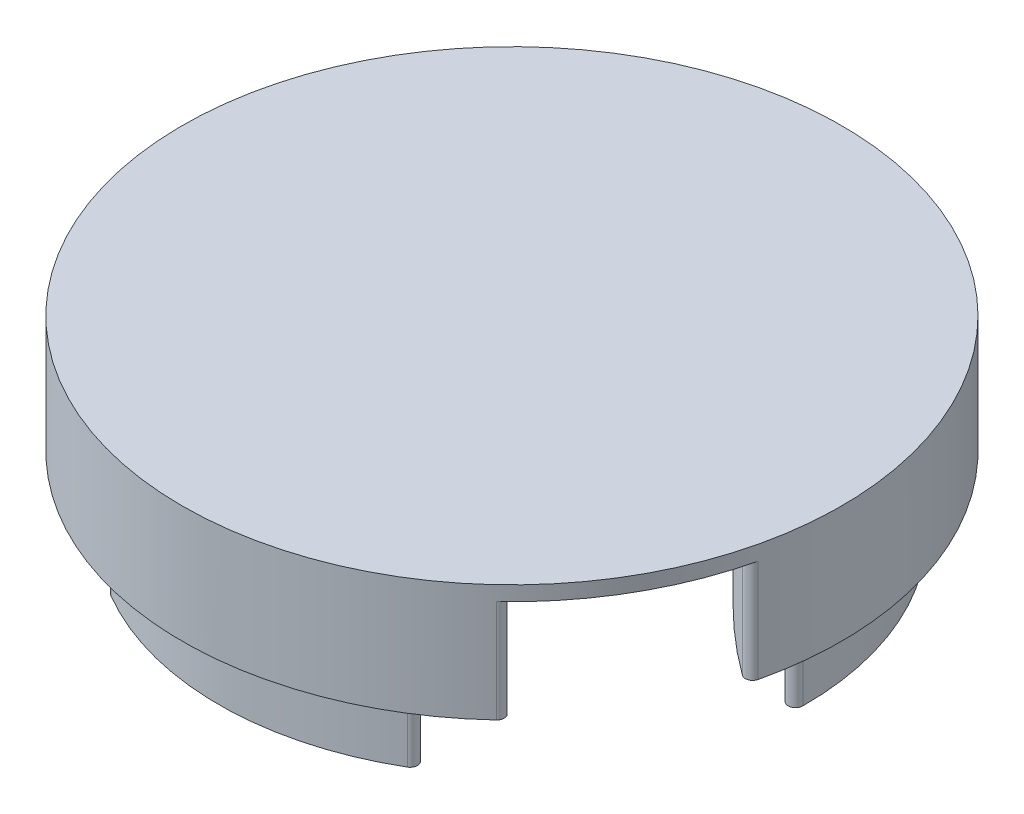
ISO-10303-21;
HEADER;
FILE_DESCRIPTION(('STEP AP214'),'2;1');
FILE_NAME('part.step','',(''),(''),'','','');
FILE_SCHEMA(('AUTOMOTIVE_DESIGN { 1 0 10303 214 1 1 1 1 }'));
ENDSEC;
DATA;
#1=APPLICATION_CONTEXT('core data for automotive mechanical design processes');
#2=APPLICATION_PROTOCOL_DEFINITION('international standard','automotive_design',2000,#1);
#3=PRODUCT_CONTEXT('',#1,'mechanical');
#4=PRODUCT('Part','Part','',(#3));
#5=PRODUCT_RELATED_PRODUCT_CATEGORY('part','',(#4));
#6=PRODUCT_DEFINITION_FORMATION('','',#4);
#7=PRODUCT_DEFINITION_CONTEXT('part definition',#1,'design');
#8=PRODUCT_DEFINITION('design','',#6,#7);
#9=PRODUCT_DEFINITION_SHAPE('','',#8);
#10=(LENGTH_UNIT() NAMED_UNIT(*) SI_UNIT(.MILLI.,.METRE.));
#11=(NAMED_UNIT(*) PLANE_ANGLE_UNIT() SI_UNIT($,.RADIAN.));
#12=(NAMED_UNIT(*) SI_UNIT($,.STERADIAN.) SOLID_ANGLE_UNIT());
#13=UNCERTAINTY_MEASURE_WITH_UNIT(LENGTH_MEASURE(1.E-05),#10,'distance_accuracy_value','');
#14=(GEOMETRIC_REPRESENTATION_CONTEXT(3) GLOBAL_UNCERTAINTY_ASSIGNED_CONTEXT((#13)) GLOBAL_UNIT_ASSIGNED_CONTEXT((#10,
#11,#12)) REPRESENTATION_CONTEXT('',''));
#15=CARTESIAN_POINT('',(0.,0.,0.));
#16=DIRECTION('',(0.,0.,1.));
#17=DIRECTION('',(1.,0.,0.));
#18=AXIS2_PLACEMENT_3D('',#15,#16,#17);
#19=CARTESIAN_POINT('',(0.,0.,0.));
#20=DIRECTION('',(0.,1.,0.));
#21=DIRECTION('',(0.,0.,1.));
#22=AXIS2_PLACEMENT_3D('',#19,#20,#21);
#23=PLANE('',#22);
#24=CARTESIAN_POINT('',(0.,0.,0.));
#25=DIRECTION('',(0.,-1.,0.));
#26=DIRECTION('',(0.866025403784443,0.,0.499999999999992));
#27=AXIS2_PLACEMENT_3D('',#24,#25,#26);
#28=CIRCLE('',#27,40.);
#29=CARTESIAN_POINT('',(-39.9989783773547,0.,0.285882437224215));
#30=VERTEX_POINT('',#29);
#31=CARTESIAN_POINT('',(-19.7519077355458,0.,-34.7830726188255));
#32=VERTEX_POINT('',#31);
#33=EDGE_CURVE('E392',#30,#32,#28,.T.);
#34=ORIENTED_EDGE('',*,*,#33,.F.);
#35=CARTESIAN_POINT('',(-38.9990039179208,0.,0.27873537629361));
#36=DIRECTION('',(0.,1.,0.));
#37=DIRECTION('',(0.,0.,1.));
#38=AXIS2_PLACEMENT_3D('',#35,#36,#37);
#39=CIRCLE('',#38,1.);
#40=CARTESIAN_POINT('',(-38.3114796497831,0.,1.0048967775824));
#41=VERTEX_POINT('',#40);
#42=EDGE_CURVE('E304',#30,#41,#39,.T.);
#43=ORIENTED_EDGE('',*,*,#42,.T.);
#44=CARTESIAN_POINT('',(-86.6025403784442,0.,-49.9999999999995));
#45=DIRECTION('',(0.,-1.,0.));
#46=DIRECTION('',(0.866025403784443,0.,0.499999999999992));
#47=AXIS2_PLACEMENT_3D('',#44,#45,#46);
#48=CIRCLE('',#47,70.2390635016656);
#49=CARTESIAN_POINT('',(-18.2854736873245,0.,-33.6811630220737));
#50=VERTEX_POINT('',#49);
#51=EDGE_CURVE('E394',#50,#41,#48,.T.);
#52=ORIENTED_EDGE('',*,*,#51,.F.);
#53=CARTESIAN_POINT('',(-19.2581100421572,0.,-33.9134958033548));
#54=DIRECTION('',(0.,1.,0.));
#55=DIRECTION('',(0.,0.,1.));
#56=AXIS2_PLACEMENT_3D('',#53,#54,#55);
#57=CIRCLE('',#56,1.);
#58=EDGE_CURVE('E306',#50,#32,#57,.T.);
#59=ORIENTED_EDGE('',*,*,#58,.T.);
#60=EDGE_LOOP('',(#34,#43,#52,#59));
#61=FACE_BOUND('',#60,.T.);
#62=CARTESIAN_POINT('',(0.,0.,0.));
#63=DIRECTION('',(0.,1.,0.));
#64=DIRECTION('',(0.,0.,1.));
#65=AXIS2_PLACEMENT_3D('',#62,#63,#64);
#66=CIRCLE('',#65,45.);
#67=CARTESIAN_POINT('',(-13.0753936075589,0.,-43.0584960490657));
#68=VERTEX_POINT('',#67);
#69=CARTESIAN_POINT('',(-43.8274482310223,0.,10.2056249959059));
#70=VERTEX_POINT('',#69);
#71=EDGE_CURVE('E254',#68,#70,#66,.T.);
#72=ORIENTED_EDGE('',*,*,#71,.F.);
#73=CARTESIAN_POINT('',(-12.7848293051687,0.,-42.1016405813087));
#74=DIRECTION('',(0.,1.,0.));
#75=DIRECTION('',(0.,0.,1.));
#76=AXIS2_PLACEMENT_3D('',#73,#74,#75);
#77=CIRCLE('',#76,1.);
#78=CARTESIAN_POINT('',(-11.790504921327,0.,-41.9952496996604));
#79=VERTEX_POINT('',#78);
#80=EDGE_CURVE('E53',#68,#79,#77,.F.);
#81=ORIENTED_EDGE('',*,*,#80,.T.);
#82=CARTESIAN_POINT('',(-86.6025403784437,0.,-50.0000000000003));
#83=DIRECTION('',(0.,1.,0.));
#84=DIRECTION('',(0.,0.,1.));
#85=AXIS2_PLACEMENT_3D('',#82,#83,#84);
#86=CIRCLE('',#85,75.2390635016656);
#87=CARTESIAN_POINT('',(-42.2642055388403,0.,10.7867480645152));
#88=VERTEX_POINT('',#87);
#89=EDGE_CURVE('E251',#88,#79,#86,.T.);
#90=ORIENTED_EDGE('',*,*,#89,.F.);
#91=CARTESIAN_POINT('',(-42.8535049369996,0.,9.97883332933023));
#92=DIRECTION('',(0.,1.,0.));
#93=DIRECTION('',(0.,0.,1.));
#94=AXIS2_PLACEMENT_3D('',#91,#92,#93);
#95=CIRCLE('',#94,1.);
#96=EDGE_CURVE('E61',#88,#70,#95,.F.);
#97=ORIENTED_EDGE('',*,*,#96,.T.);
#98=EDGE_LOOP('',(#72,#81,#90,#97));
#99=FACE_BOUND('',#98,.T.);
#100=ADVANCED_FACE('F38',(#61,#99),#23,.F.);
#101=CARTESIAN_POINT('',(0.,0.,0.));
#102=DIRECTION('',(0.,-1.,0.));
#103=DIRECTION('',(-0.866025403784436,0.,0.500000000000004));
#104=AXIS2_PLACEMENT_3D('',#101,#102,#103);
#105=CIRCLE('',#104,40.);
#106=CARTESIAN_POINT('',(19.7519077355456,0.,-34.7830726188256));
#107=VERTEX_POINT('',#106);
#108=CARTESIAN_POINT('',(39.9989783773547,0.,0.285882437223873));
#109=VERTEX_POINT('',#108);
#110=EDGE_CURVE('E408',#107,#109,#105,.T.);
#111=ORIENTED_EDGE('',*,*,#110,.F.);
#112=CARTESIAN_POINT('',(19.2581100421569,0.,-33.913495803355));
#113=DIRECTION('',(0.,1.,0.));
#114=DIRECTION('',(0.,0.,1.));
#115=AXIS2_PLACEMENT_3D('',#112,#113,#114);
#116=CIRCLE('',#115,1.);
#117=CARTESIAN_POINT('',(18.2854736873243,0.,-33.6811630220738));
#118=VERTEX_POINT('',#117);
#119=EDGE_CURVE('E286',#107,#118,#116,.T.);
#120=ORIENTED_EDGE('',*,*,#119,.T.);
#121=CARTESIAN_POINT('',(86.6025403784438,0.,-50.0000000000001));
#122=DIRECTION('',(0.,-1.,0.));
#123=DIRECTION('',(-0.866025403784436,0.,0.500000000000004));
#124=AXIS2_PLACEMENT_3D('',#121,#122,#123);
#125=CIRCLE('',#124,70.2390635016656);
#126=CARTESIAN_POINT('',(38.3114796497831,0.,1.00489677758207));
#127=VERTEX_POINT('',#126);
#128=EDGE_CURVE('E406',#127,#118,#125,.T.);
#129=ORIENTED_EDGE('',*,*,#128,.F.);
#130=CARTESIAN_POINT('',(38.9990039179208,0.,0.278735376293276));
#131=DIRECTION('',(0.,1.,0.));
#132=DIRECTION('',(0.,0.,1.));
#133=AXIS2_PLACEMENT_3D('',#130,#131,#132);
#134=CIRCLE('',#133,1.);
#135=EDGE_CURVE('E288',#127,#109,#134,.T.);
#136=ORIENTED_EDGE('',*,*,#135,.T.);
#137=EDGE_LOOP('',(#111,#120,#129,#136));
#138=FACE_BOUND('',#137,.T.);
#139=CARTESIAN_POINT('',(43.8274482310222,0.,10.2056249959062));
#140=VERTEX_POINT('',#139);
#141=CARTESIAN_POINT('',(13.0753936075592,0.,-43.0584960490656));
#142=VERTEX_POINT('',#141);
#143=EDGE_CURVE('E257',#140,#142,#66,.T.);
#144=ORIENTED_EDGE('',*,*,#143,.F.);
#145=CARTESIAN_POINT('',(42.8535049369995,0.,9.97883332933053));
#146=DIRECTION('',(0.,1.,0.));
#147=DIRECTION('',(0.,0.,1.));
#148=AXIS2_PLACEMENT_3D('',#145,#146,#147);
#149=CIRCLE('',#148,1.);
#150=CARTESIAN_POINT('',(42.2642055388402,0.,10.7867480645155));
#151=VERTEX_POINT('',#150);
#152=EDGE_CURVE('E341',#140,#151,#149,.F.);
#153=ORIENTED_EDGE('',*,*,#152,.T.);
#154=CARTESIAN_POINT('',(86.602540378444,0.,-49.9999999999997));
#155=DIRECTION('',(0.,1.,0.));
#156=DIRECTION('',(0.,0.,1.));
#157=AXIS2_PLACEMENT_3D('',#154,#155,#156);
#158=CIRCLE('',#157,75.2390635016656);
#159=CARTESIAN_POINT('',(11.7905049213273,0.,-41.9952496996603));
#160=VERTEX_POINT('',#159);
#161=EDGE_CURVE('E245',#160,#151,#158,.T.);
#162=ORIENTED_EDGE('',*,*,#161,.F.);
#163=CARTESIAN_POINT('',(12.784829305169,0.,-42.1016405813086));
#164=DIRECTION('',(0.,1.,0.));
#165=DIRECTION('',(0.,0.,1.));
#166=AXIS2_PLACEMENT_3D('',#163,#164,#165);
#167=CIRCLE('',#166,1.);
#168=EDGE_CURVE('E339',#160,#142,#167,.F.);
#169=ORIENTED_EDGE('',*,*,#168,.T.);
#170=EDGE_LOOP('',(#144,#153,#162,#169));
#171=FACE_BOUND('',#170,.T.);
#172=ADVANCED_FACE('F435',(#138,#171),#23,.F.);
#173=CARTESIAN_POINT('',(0.,0.,0.));
#174=DIRECTION('',(0.,-1.,0.));
#175=DIRECTION('',(0.,0.,-1.));
#176=AXIS2_PLACEMENT_3D('',#173,#174,#175);
#177=CIRCLE('',#176,40.);
#178=CARTESIAN_POINT('',(20.247070641809,0.,34.4971901816017));
#179=VERTEX_POINT('',#178);
#180=CARTESIAN_POINT('',(-20.2470706418092,0.,34.4971901816016));
#181=VERTEX_POINT('',#180);
#182=EDGE_CURVE('E219',#179,#181,#177,.T.);
#183=ORIENTED_EDGE('',*,*,#182,.F.);
#184=CARTESIAN_POINT('',(19.7408938757638,0.,33.6347604270617));
#185=DIRECTION('',(0.,1.,0.));
#186=DIRECTION('',(0.,0.,1.));
#187=AXIS2_PLACEMENT_3D('',#184,#185,#186);
#188=CIRCLE('',#187,1.);
#189=CARTESIAN_POINT('',(20.0260059624587,0.,32.6762662444917));
#190=VERTEX_POINT('',#189);
#191=EDGE_CURVE('E202',#179,#190,#188,.T.);
#192=ORIENTED_EDGE('',*,*,#191,.T.);
#193=CARTESIAN_POINT('',(-3.05311331771918E-13,0.,100.));
#194=DIRECTION('',(0.,-1.,0.));
#195=DIRECTION('',(0.,0.,-1.));
#196=AXIS2_PLACEMENT_3D('',#193,#194,#195);
#197=CIRCLE('',#196,70.2390635016656);
#198=CARTESIAN_POINT('',(-20.0260059624589,0.,32.6762662444916));
#199=VERTEX_POINT('',#198);
#200=EDGE_CURVE('E228',#199,#190,#197,.T.);
#201=ORIENTED_EDGE('',*,*,#200,.F.);
#202=CARTESIAN_POINT('',(-19.740893875764,0.,33.6347604270615));
#203=DIRECTION('',(0.,1.,0.));
#204=DIRECTION('',(0.,0.,1.));
#205=AXIS2_PLACEMENT_3D('',#202,#203,#204);
#206=CIRCLE('',#205,1.);
#207=EDGE_CURVE('E212',#199,#181,#206,.T.);
#208=ORIENTED_EDGE('',*,*,#207,.T.);
#209=EDGE_LOOP('',(#183,#192,#201,#208));
#210=FACE_BOUND('',#209,.T.);
#211=CARTESIAN_POINT('',(-3.05311331771918E-13,0.,100.));
#212=DIRECTION('',(0.,1.,0.));
#213=DIRECTION('',(0.,0.,1.));
#214=AXIS2_PLACEMENT_3D('',#211,#212,#213);
#215=CIRCLE('',#214,75.2390635016656);
#216=CARTESIAN_POINT('',(30.473700617513,0.,31.208501635145));
#217=VERTEX_POINT('',#216);
#218=CARTESIAN_POINT('',(-30.4737006175132,0.,31.2085016351449));
#219=VERTEX_POINT('',#218);
#220=EDGE_CURVE('E258',#217,#219,#215,.T.);
#221=ORIENTED_EDGE('',*,*,#220,.F.);
#222=CARTESIAN_POINT('',(30.0686756318307,0.,32.1228072519784));
#223=DIRECTION('',(0.,1.,0.));
#224=DIRECTION('',(0.,0.,1.));
#225=AXIS2_PLACEMENT_3D('',#222,#223,#224);
#226=CIRCLE('',#225,1.);
#227=CARTESIAN_POINT('',(30.7520546234632,0.,32.8528710531597));
#228=VERTEX_POINT('',#227);
#229=EDGE_CURVE('E316',#217,#228,#226,.F.);
#230=ORIENTED_EDGE('',*,*,#229,.T.);
#231=CARTESIAN_POINT('',(-30.7520546234634,0.,32.8528710531595));
#232=VERTEX_POINT('',#231);
#233=EDGE_CURVE('E253',#232,#228,#66,.T.);
#234=ORIENTED_EDGE('',*,*,#233,.F.);
#235=CARTESIAN_POINT('',(-30.0686756318308,0.,32.1228072519782));
#236=DIRECTION('',(0.,1.,0.));
#237=DIRECTION('',(0.,0.,1.));
#238=AXIS2_PLACEMENT_3D('',#235,#236,#237);
#239=CIRCLE('',#238,1.);
#240=EDGE_CURVE('E314',#232,#219,#239,.F.);
#241=ORIENTED_EDGE('',*,*,#240,.T.);
#242=EDGE_LOOP('',(#221,#230,#234,#241));
#243=FACE_BOUND('',#242,.T.);
#244=ADVANCED_FACE('F226',(#210,#243),#23,.F.);
#245=CARTESIAN_POINT('',(0.,14.,0.));
#246=DIRECTION('',(0.,-1.,0.));
#247=DIRECTION('',(0.,0.,-1.));
#248=AXIS2_PLACEMENT_3D('',#245,#246,#247);
#249=CYLINDRICAL_SURFACE('',#248,45.);
#250=DIRECTION('',(0.,-1.,0.));
#251=VECTOR('',#250,1.);
#252=CARTESIAN_POINT('',(-43.8274482310223,14.,10.2056249959059));
#253=LINE('',#252,#251);
#254=CARTESIAN_POINT('',(-43.8274482310223,14.,10.2056249959059));
#255=VERTEX_POINT('',#254);
#256=EDGE_CURVE('E318',#70,#255,#253,.F.);
#257=ORIENTED_EDGE('',*,*,#256,.T.);
#258=CARTESIAN_POINT('',(0.,14.,0.));
#259=DIRECTION('',(0.,-1.,0.));
#260=DIRECTION('',(0.,0.,-1.));
#261=AXIS2_PLACEMENT_3D('',#258,#259,#260);
#262=CIRCLE('',#261,45.);
#263=CARTESIAN_POINT('',(-30.7520546234634,14.,32.8528710531595));
#264=VERTEX_POINT('',#263);
#265=EDGE_CURVE('E365',#264,#255,#262,.T.);
#266=ORIENTED_EDGE('',*,*,#265,.F.);
#267=DIRECTION('',(0.,-1.,0.));
#268=VECTOR('',#267,1.);
#269=CARTESIAN_POINT('',(-30.7520546234634,14.,32.8528710531595));
#270=LINE('',#269,#268);
#271=EDGE_CURVE('E321',#264,#232,#270,.T.);
#272=ORIENTED_EDGE('',*,*,#271,.T.);
#273=ORIENTED_EDGE('',*,*,#233,.T.);
#274=DIRECTION('',(0.,-1.,0.));
#275=VECTOR('',#274,1.);
#276=CARTESIAN_POINT('',(30.7520546234632,14.,32.8528710531597));
#277=LINE('',#276,#275);
#278=CARTESIAN_POINT('',(30.7520546234632,14.,32.8528710531597));
#279=VERTEX_POINT('',#278);
#280=EDGE_CURVE('E330',#228,#279,#277,.F.);
#281=ORIENTED_EDGE('',*,*,#280,.T.);
#282=CARTESIAN_POINT('',(43.8274482310222,14.,10.2056249959062));
#283=VERTEX_POINT('',#282);
#284=EDGE_CURVE('E390',#283,#279,#262,.T.);
#285=ORIENTED_EDGE('',*,*,#284,.F.);
#286=DIRECTION('',(0.,-1.,0.));
#287=VECTOR('',#286,1.);
#288=CARTESIAN_POINT('',(43.8274482310222,14.,10.2056249959062));
#289=LINE('',#288,#287);
#290=EDGE_CURVE('E328',#283,#140,#289,.T.);
#291=ORIENTED_EDGE('',*,*,#290,.T.);
#292=ORIENTED_EDGE('',*,*,#143,.T.);
#293=DIRECTION('',(0.,-1.,0.));
#294=VECTOR('',#293,1.);
#295=CARTESIAN_POINT('',(13.0753936075592,14.,-43.0584960490656));
#296=LINE('',#295,#294);
#297=CARTESIAN_POINT('',(13.0753936075592,14.,-43.0584960490656));
#298=VERTEX_POINT('',#297);
#299=EDGE_CURVE('E325',#142,#298,#296,.F.);
#300=ORIENTED_EDGE('',*,*,#299,.T.);
#301=CARTESIAN_POINT('',(-13.0753936075589,14.,-43.0584960490657));
#302=VERTEX_POINT('',#301);
#303=EDGE_CURVE('E387',#302,#298,#262,.T.);
#304=ORIENTED_EDGE('',*,*,#303,.F.);
#305=DIRECTION('',(0.,-1.,0.));
#306=VECTOR('',#305,1.);
#307=CARTESIAN_POINT('',(-13.0753936075589,14.,-43.0584960490657));
#308=LINE('',#307,#306);
#309=EDGE_CURVE('E323',#302,#68,#308,.T.);
#310=ORIENTED_EDGE('',*,*,#309,.T.);
#311=ORIENTED_EDGE('',*,*,#71,.T.);
#312=EDGE_LOOP('',(#257,#266,#272,#273,#281,#285,#291,#292,#300,#304,#310,#311));
#313=FACE_BOUND('',#312,.T.);
#314=CARTESIAN_POINT('',(0.,16.,0.));
#315=DIRECTION('',(0.,1.,0.));
#316=DIRECTION('',(0.,0.,1.));
#317=AXIS2_PLACEMENT_3D('',#314,#315,#316);
#318=CIRCLE('',#317,45.);
#319=CARTESIAN_POINT('',(0.,16.,45.));
#320=VERTEX_POINT('',#319);
#321=EDGE_CURVE('E239',#320,#320,#318,.T.);
#322=ORIENTED_EDGE('',*,*,#321,.F.);
#323=EDGE_LOOP('',(#322));
#324=FACE_BOUND('',#323,.T.);
#325=ADVANCED_FACE('F373',(#313,#324),#249,.T.);
#326=CARTESIAN_POINT('',(-3.05311331771918E-13,0.,100.));
#327=DIRECTION('',(0.,1.,0.));
#328=DIRECTION('',(0.,0.,1.));
#329=AXIS2_PLACEMENT_3D('',#326,#327,#328);
#330=CYLINDRICAL_SURFACE('',#329,75.2390635016656);
#331=CARTESIAN_POINT('',(-3.05311331771918E-13,14.,100.));
#332=DIRECTION('',(0.,1.,0.));
#333=DIRECTION('',(0.,0.,1.));
#334=AXIS2_PLACEMENT_3D('',#331,#332,#333);
#335=CIRCLE('',#334,75.2390635016656);
#336=CARTESIAN_POINT('',(30.473700617513,14.,31.208501635145));
#337=VERTEX_POINT('',#336);
#338=CARTESIAN_POINT('',(-30.4737006175132,14.,31.2085016351449));
#339=VERTEX_POINT('',#338);
#340=EDGE_CURVE('E261',#337,#339,#335,.T.);
#341=ORIENTED_EDGE('',*,*,#340,.F.);
#342=DIRECTION('',(0.,1.,0.));
#343=VECTOR('',#342,1.);
#344=CARTESIAN_POINT('',(30.473700617513,0.,31.208501635145));
#345=LINE('',#344,#343);
#346=EDGE_CURVE('E311',#337,#217,#345,.F.);
#347=ORIENTED_EDGE('',*,*,#346,.T.);
#348=ORIENTED_EDGE('',*,*,#220,.T.);
#349=DIRECTION('',(0.,1.,0.));
#350=VECTOR('',#349,1.);
#351=CARTESIAN_POINT('',(-30.4737006175132,0.,31.2085016351448));
#352=LINE('',#351,#350);
#353=EDGE_CURVE('E308',#219,#339,#352,.T.);
#354=ORIENTED_EDGE('',*,*,#353,.T.);
#355=EDGE_LOOP('',(#341,#347,#348,#354));
#356=FACE_BOUND('',#355,.T.);
#357=ADVANCED_FACE('F448',(#356),#330,.T.);
#358=CARTESIAN_POINT('',(-86.6025403784437,0.,-50.0000000000003));
#359=DIRECTION('',(0.,1.,0.));
#360=DIRECTION('',(0.,0.,1.));
#361=AXIS2_PLACEMENT_3D('',#358,#359,#360);
#362=CYLINDRICAL_SURFACE('',#361,75.2390635016656);
#363=CARTESIAN_POINT('',(-86.6025403784437,14.,-50.0000000000003));
#364=DIRECTION('',(0.,1.,0.));
#365=DIRECTION('',(0.,0.,1.));
#366=AXIS2_PLACEMENT_3D('',#363,#364,#365);
#367=CIRCLE('',#366,75.2390635016656);
#368=CARTESIAN_POINT('',(-42.2642055388403,14.,10.7867480645152));
#369=VERTEX_POINT('',#368);
#370=CARTESIAN_POINT('',(-11.790504921327,14.,-41.9952496996604));
#371=VERTEX_POINT('',#370);
#372=EDGE_CURVE('E248',#369,#371,#367,.T.);
#373=ORIENTED_EDGE('',*,*,#372,.F.);
#374=DIRECTION('',(0.,1.,0.));
#375=VECTOR('',#374,1.);
#376=CARTESIAN_POINT('',(-42.2642055388403,0.,10.7867480645152));
#377=LINE('',#376,#375);
#378=EDGE_CURVE('E343',#369,#88,#377,.F.);
#379=ORIENTED_EDGE('',*,*,#378,.T.);
#380=ORIENTED_EDGE('',*,*,#89,.T.);
#381=DIRECTION('',(0.,1.,0.));
#382=VECTOR('',#381,1.);
#383=CARTESIAN_POINT('',(-11.790504921327,0.,-41.9952496996604));
#384=LINE('',#383,#382);
#385=EDGE_CURVE('E345',#79,#371,#384,.T.);
#386=ORIENTED_EDGE('',*,*,#385,.T.);
#387=EDGE_LOOP('',(#373,#379,#380,#386));
#388=FACE_BOUND('',#387,.T.);
#389=ADVANCED_FACE('F453',(#388),#362,.T.);
#390=CARTESIAN_POINT('',(86.602540378444,0.,-49.9999999999997));
#391=DIRECTION('',(0.,1.,0.));
#392=DIRECTION('',(0.,0.,1.));
#393=AXIS2_PLACEMENT_3D('',#390,#391,#392);
#394=CYLINDRICAL_SURFACE('',#393,75.2390635016656);
#395=CARTESIAN_POINT('',(86.602540378444,14.,-49.9999999999997));
#396=DIRECTION('',(0.,1.,0.));
#397=DIRECTION('',(0.,0.,1.));
#398=AXIS2_PLACEMENT_3D('',#395,#396,#397);
#399=CIRCLE('',#398,75.2390635016656);
#400=CARTESIAN_POINT('',(11.7905049213273,14.,-41.9952496996603));
#401=VERTEX_POINT('',#400);
#402=CARTESIAN_POINT('',(42.2642055388402,14.,10.7867480645155));
#403=VERTEX_POINT('',#402);
#404=EDGE_CURVE('E242',#401,#403,#399,.T.);
#405=ORIENTED_EDGE('',*,*,#404,.F.);
#406=DIRECTION('',(0.,1.,0.));
#407=VECTOR('',#406,1.);
#408=CARTESIAN_POINT('',(11.7905049213273,0.,-41.9952496996603));
#409=LINE('',#408,#407);
#410=EDGE_CURVE('E333',#401,#160,#409,.F.);
#411=ORIENTED_EDGE('',*,*,#410,.T.);
#412=ORIENTED_EDGE('',*,*,#161,.T.);
#413=DIRECTION('',(0.,1.,0.));
#414=VECTOR('',#413,1.);
#415=CARTESIAN_POINT('',(42.2642055388402,0.,10.7867480645155));
#416=LINE('',#415,#414);
#417=EDGE_CURVE('E336',#151,#403,#416,.T.);
#418=ORIENTED_EDGE('',*,*,#417,.T.);
#419=EDGE_LOOP('',(#405,#411,#412,#418));
#420=FACE_BOUND('',#419,.T.);
#421=ADVANCED_FACE('F458',(#420),#394,.T.);
#422=CARTESIAN_POINT('',(0.,14.,0.));
#423=DIRECTION('',(0.,1.,0.));
#424=DIRECTION('',(0.,0.,1.));
#425=AXIS2_PLACEMENT_3D('',#422,#423,#424);
#426=PLANE('',#425);
#427=CARTESIAN_POINT('',(-42.8535049369996,14.,9.97883332933023));
#428=DIRECTION('',(0.,1.,0.));
#429=DIRECTION('',(0.,0.,1.));
#430=AXIS2_PLACEMENT_3D('',#427,#428,#429);
#431=CIRCLE('',#430,1.);
#432=EDGE_CURVE('E12',#255,#369,#431,.T.);
#433=ORIENTED_EDGE('',*,*,#432,.T.);
#434=ORIENTED_EDGE('',*,*,#372,.T.);
#435=CARTESIAN_POINT('',(-12.7848293051687,14.,-42.1016405813087));
#436=DIRECTION('',(0.,1.,0.));
#437=DIRECTION('',(0.,0.,1.));
#438=AXIS2_PLACEMENT_3D('',#435,#436,#437);
#439=CIRCLE('',#438,1.);
#440=EDGE_CURVE('E359',#371,#302,#439,.T.);
#441=ORIENTED_EDGE('',*,*,#440,.T.);
#442=ORIENTED_EDGE('',*,*,#303,.T.);
#443=CARTESIAN_POINT('',(12.784829305169,14.,-42.1016405813086));
#444=DIRECTION('',(0.,1.,0.));
#445=DIRECTION('',(0.,0.,1.));
#446=AXIS2_PLACEMENT_3D('',#443,#444,#445);
#447=CIRCLE('',#446,1.);
#448=EDGE_CURVE('E356',#298,#401,#447,.T.);
#449=ORIENTED_EDGE('',*,*,#448,.T.);
#450=ORIENTED_EDGE('',*,*,#404,.T.);
#451=CARTESIAN_POINT('',(42.8535049369995,14.,9.97883332933053));
#452=DIRECTION('',(0.,1.,0.));
#453=DIRECTION('',(0.,0.,1.));
#454=AXIS2_PLACEMENT_3D('',#451,#452,#453);
#455=CIRCLE('',#454,1.);
#456=EDGE_CURVE('E353',#403,#283,#455,.T.);
#457=ORIENTED_EDGE('',*,*,#456,.T.);
#458=ORIENTED_EDGE('',*,*,#284,.T.);
#459=CARTESIAN_POINT('',(30.0686756318307,14.,32.1228072519784));
#460=DIRECTION('',(0.,1.,0.));
#461=DIRECTION('',(0.,0.,1.));
#462=AXIS2_PLACEMENT_3D('',#459,#460,#461);
#463=CIRCLE('',#462,1.);
#464=EDGE_CURVE('E350',#279,#337,#463,.T.);
#465=ORIENTED_EDGE('',*,*,#464,.T.);
#466=ORIENTED_EDGE('',*,*,#340,.T.);
#467=CARTESIAN_POINT('',(-30.0686756318308,14.,32.1228072519782));
#468=DIRECTION('',(0.,1.,0.));
#469=DIRECTION('',(0.,0.,1.));
#470=AXIS2_PLACEMENT_3D('',#467,#468,#469);
#471=CIRCLE('',#470,1.);
#472=EDGE_CURVE('E46',#339,#264,#471,.T.);
#473=ORIENTED_EDGE('',*,*,#472,.T.);
#474=ORIENTED_EDGE('',*,*,#265,.T.);
#475=EDGE_LOOP('',(#433,#434,#441,#442,#449,#450,#457,#458,#465,#466,#473,#474));
#476=FACE_BOUND('',#475,.T.);
#477=ADVANCED_FACE('F364',(#476),#426,.F.);
#478=CARTESIAN_POINT('',(0.,16.,0.));
#479=DIRECTION('',(0.,1.,0.));
#480=DIRECTION('',(0.,0.,1.));
#481=AXIS2_PLACEMENT_3D('',#478,#479,#480);
#482=PLANE('',#481);
#483=ORIENTED_EDGE('',*,*,#321,.T.);
#484=EDGE_LOOP('',(#483));
#485=FACE_BOUND('',#484,.T.);
#486=ADVANCED_FACE('F465',(#485),#482,.T.);
#487=CARTESIAN_POINT('',(0.,-10.,0.));
#488=DIRECTION('',(0.,1.,0.));
#489=DIRECTION('',(0.,0.,1.));
#490=AXIS2_PLACEMENT_3D('',#487,#488,#489);
#491=CYLINDRICAL_SURFACE('',#490,40.);
#492=CARTESIAN_POINT('',(0.,-10.,0.));
#493=DIRECTION('',(0.,-1.,0.));
#494=DIRECTION('',(0.,0.,-1.));
#495=AXIS2_PLACEMENT_3D('',#492,#493,#494);
#496=CIRCLE('',#495,40.);
#497=CARTESIAN_POINT('',(20.247070641809,-10.,34.4971901816017));
#498=VERTEX_POINT('',#497);
#499=CARTESIAN_POINT('',(-20.2470706418092,-10.,34.4971901816016));
#500=VERTEX_POINT('',#499);
#501=EDGE_CURVE('E222',#498,#500,#496,.T.);
#502=ORIENTED_EDGE('',*,*,#501,.F.);
#503=DIRECTION('',(0.,1.,0.));
#504=VECTOR('',#503,1.);
#505=CARTESIAN_POINT('',(20.247070641809,-10.,34.4971901816017));
#506=LINE('',#505,#504);
#507=EDGE_CURVE('E206',#498,#179,#506,.T.);
#508=ORIENTED_EDGE('',*,*,#507,.T.);
#509=ORIENTED_EDGE('',*,*,#182,.T.);
#510=DIRECTION('',(0.,1.,0.));
#511=VECTOR('',#510,1.);
#512=CARTESIAN_POINT('',(-20.2470706418092,-10.,34.4971901816016));
#513=LINE('',#512,#511);
#514=EDGE_CURVE('E224',#181,#500,#513,.F.);
#515=ORIENTED_EDGE('',*,*,#514,.T.);
#516=EDGE_LOOP('',(#502,#508,#509,#515));
#517=FACE_BOUND('',#516,.T.);
#518=ADVANCED_FACE('F218',(#517),#491,.T.);
#519=CARTESIAN_POINT('',(-3.05311331771918E-13,-10.,100.));
#520=DIRECTION('',(0.,1.,0.));
#521=DIRECTION('',(0.,0.,1.));
#522=AXIS2_PLACEMENT_3D('',#519,#520,#521);
#523=CYLINDRICAL_SURFACE('',#522,70.2390635016656);
#524=ORIENTED_EDGE('',*,*,#200,.T.);
#525=DIRECTION('',(0.,1.,0.));
#526=VECTOR('',#525,1.);
#527=CARTESIAN_POINT('',(20.0260059624587,-10.,32.6762662444917));
#528=LINE('',#527,#526);
#529=CARTESIAN_POINT('',(20.0260059624587,-10.,32.6762662444917));
#530=VERTEX_POINT('',#529);
#531=EDGE_CURVE('E207',#190,#530,#528,.F.);
#532=ORIENTED_EDGE('',*,*,#531,.T.);
#533=CARTESIAN_POINT('',(-3.05311331771918E-13,-10.,100.));
#534=DIRECTION('',(0.,-1.,0.));
#535=DIRECTION('',(0.,0.,-1.));
#536=AXIS2_PLACEMENT_3D('',#533,#534,#535);
#537=CIRCLE('',#536,70.2390635016656);
#538=CARTESIAN_POINT('',(-20.0260059624589,-10.,32.6762662444916));
#539=VERTEX_POINT('',#538);
#540=EDGE_CURVE('E236',#539,#530,#537,.T.);
#541=ORIENTED_EDGE('',*,*,#540,.F.);
#542=DIRECTION('',(0.,1.,0.));
#543=VECTOR('',#542,1.);
#544=CARTESIAN_POINT('',(-20.0260059624589,-10.,32.6762662444916));
#545=LINE('',#544,#543);
#546=EDGE_CURVE('E223',#539,#199,#545,.T.);
#547=ORIENTED_EDGE('',*,*,#546,.T.);
#548=EDGE_LOOP('',(#524,#532,#541,#547));
#549=FACE_BOUND('',#548,.T.);
#550=ADVANCED_FACE('F419',(#549),#523,.T.);
#551=CARTESIAN_POINT('',(-1.52655665885959E-13,-10.,50.));
#552=DIRECTION('',(0.,-1.,0.));
#553=DIRECTION('',(0.,0.,-1.));
#554=AXIS2_PLACEMENT_3D('',#551,#552,#553);
#555=PLANE('',#554);
#556=ORIENTED_EDGE('',*,*,#540,.T.);
#557=CARTESIAN_POINT('',(19.7408938757638,-10.,33.6347604270617));
#558=DIRECTION('',(0.,-1.,0.));
#559=DIRECTION('',(0.,0.,-1.));
#560=AXIS2_PLACEMENT_3D('',#557,#558,#559);
#561=CIRCLE('',#560,1.);
#562=EDGE_CURVE('E213',#530,#498,#561,.T.);
#563=ORIENTED_EDGE('',*,*,#562,.T.);
#564=ORIENTED_EDGE('',*,*,#501,.T.);
#565=CARTESIAN_POINT('',(-19.740893875764,-10.,33.6347604270615));
#566=DIRECTION('',(0.,-1.,0.));
#567=DIRECTION('',(0.,0.,-1.));
#568=AXIS2_PLACEMENT_3D('',#565,#566,#567);
#569=CIRCLE('',#568,1.);
#570=EDGE_CURVE('E268',#500,#539,#569,.T.);
#571=ORIENTED_EDGE('',*,*,#570,.T.);
#572=EDGE_LOOP('',(#556,#563,#564,#571));
#573=FACE_BOUND('',#572,.T.);
#574=ADVANCED_FACE('F416',(#573),#555,.T.);
#575=CARTESIAN_POINT('',(19.7408938757638,-10.,33.6347604270617));
#576=DIRECTION('',(0.,1.,0.));
#577=DIRECTION('',(0.,0.,1.));
#578=AXIS2_PLACEMENT_3D('',#575,#576,#577);
#579=CYLINDRICAL_SURFACE('',#578,1.);
#580=ORIENTED_EDGE('',*,*,#562,.F.);
#581=ORIENTED_EDGE('',*,*,#531,.F.);
#582=ORIENTED_EDGE('',*,*,#191,.F.);
#583=ORIENTED_EDGE('',*,*,#507,.F.);
#584=EDGE_LOOP('',(#580,#581,#582,#583));
#585=FACE_BOUND('',#584,.T.);
#586=ADVANCED_FACE('F205',(#585),#579,.T.);
#587=CARTESIAN_POINT('',(-19.740893875764,-10.,33.6347604270615));
#588=DIRECTION('',(0.,1.,0.));
#589=DIRECTION('',(0.,0.,1.));
#590=AXIS2_PLACEMENT_3D('',#587,#588,#589);
#591=CYLINDRICAL_SURFACE('',#590,1.);
#592=ORIENTED_EDGE('',*,*,#570,.F.);
#593=ORIENTED_EDGE('',*,*,#514,.F.);
#594=ORIENTED_EDGE('',*,*,#207,.F.);
#595=ORIENTED_EDGE('',*,*,#546,.F.);
#596=EDGE_LOOP('',(#592,#593,#594,#595));
#597=FACE_BOUND('',#596,.T.);
#598=ADVANCED_FACE('F421',(#597),#591,.T.);
#599=CARTESIAN_POINT('',(0.,-10.,0.));
#600=DIRECTION('',(0.,1.,0.));
#601=DIRECTION('',(0.,0.,1.));
#602=AXIS2_PLACEMENT_3D('',#599,#600,#601);
#603=CYLINDRICAL_SURFACE('',#602,40.);
#604=CARTESIAN_POINT('',(0.,-10.,0.));
#605=DIRECTION('',(0.,-1.,0.));
#606=DIRECTION('',(-0.866025403784436,0.,0.500000000000004));
#607=AXIS2_PLACEMENT_3D('',#604,#605,#606);
#608=CIRCLE('',#607,40.);
#609=CARTESIAN_POINT('',(19.7519077355456,-10.,-34.7830726188256));
#610=VERTEX_POINT('',#609);
#611=CARTESIAN_POINT('',(39.9989783773547,-10.,0.285882437223873));
#612=VERTEX_POINT('',#611);
#613=EDGE_CURVE('E233',#610,#612,#608,.T.);
#614=ORIENTED_EDGE('',*,*,#613,.F.);
#615=DIRECTION('',(0.,1.,0.));
#616=VECTOR('',#615,1.);
#617=CARTESIAN_POINT('',(19.7519077355456,-10.,-34.7830726188256));
#618=LINE('',#617,#616);
#619=EDGE_CURVE('E274',#610,#107,#618,.T.);
#620=ORIENTED_EDGE('',*,*,#619,.T.);
#621=ORIENTED_EDGE('',*,*,#110,.T.);
#622=DIRECTION('',(0.,1.,0.));
#623=VECTOR('',#622,1.);
#624=CARTESIAN_POINT('',(39.9989783773547,-10.,0.285882437223873));
#625=LINE('',#624,#623);
#626=EDGE_CURVE('E272',#109,#612,#625,.F.);
#627=ORIENTED_EDGE('',*,*,#626,.T.);
#628=EDGE_LOOP('',(#614,#620,#621,#627));
#629=FACE_BOUND('',#628,.T.);
#630=ADVANCED_FACE('F423',(#629),#603,.T.);
#631=CARTESIAN_POINT('',(86.6025403784438,-10.,-50.0000000000001));
#632=DIRECTION('',(0.,1.,0.));
#633=DIRECTION('',(0.,0.,1.));
#634=AXIS2_PLACEMENT_3D('',#631,#632,#633);
#635=CYLINDRICAL_SURFACE('',#634,70.2390635016656);
#636=ORIENTED_EDGE('',*,*,#128,.T.);
#637=DIRECTION('',(0.,1.,0.));
#638=VECTOR('',#637,1.);
#639=CARTESIAN_POINT('',(18.2854736873242,-10.,-33.6811630220738));
#640=LINE('',#639,#638);
#641=CARTESIAN_POINT('',(18.2854736873243,-10.,-33.6811630220738));
#642=VERTEX_POINT('',#641);
#643=EDGE_CURVE('E280',#118,#642,#640,.F.);
#644=ORIENTED_EDGE('',*,*,#643,.T.);
#645=CARTESIAN_POINT('',(86.6025403784438,-10.,-50.0000000000001));
#646=DIRECTION('',(0.,-1.,0.));
#647=DIRECTION('',(-0.866025403784436,0.,0.500000000000004));
#648=AXIS2_PLACEMENT_3D('',#645,#646,#647);
#649=CIRCLE('',#648,70.2390635016656);
#650=CARTESIAN_POINT('',(38.3114796497831,-10.,1.00489677758207));
#651=VERTEX_POINT('',#650);
#652=EDGE_CURVE('E229',#651,#642,#649,.T.);
#653=ORIENTED_EDGE('',*,*,#652,.F.);
#654=DIRECTION('',(0.,1.,0.));
#655=VECTOR('',#654,1.);
#656=CARTESIAN_POINT('',(38.3114796497831,-10.,1.00489677758208));
#657=LINE('',#656,#655);
#658=EDGE_CURVE('E277',#651,#127,#657,.T.);
#659=ORIENTED_EDGE('',*,*,#658,.T.);
#660=EDGE_LOOP('',(#636,#644,#653,#659));
#661=FACE_BOUND('',#660,.T.);
#662=ADVANCED_FACE('F429',(#661),#635,.T.);
#663=CARTESIAN_POINT('',(43.3012701892219,-10.,-25.0000000000001));
#664=DIRECTION('',(0.,-1.,0.));
#665=DIRECTION('',(-0.866025403784436,0.,0.500000000000004));
#666=AXIS2_PLACEMENT_3D('',#663,#664,#665);
#667=PLANE('',#666);
#668=ORIENTED_EDGE('',*,*,#652,.T.);
#669=CARTESIAN_POINT('',(19.2581100421569,-10.,-33.913495803355));
#670=DIRECTION('',(0.,-1.,0.));
#671=DIRECTION('',(0.,0.,-1.));
#672=AXIS2_PLACEMENT_3D('',#669,#670,#671);
#673=CIRCLE('',#672,1.);
#674=EDGE_CURVE('E284',#642,#610,#673,.T.);
#675=ORIENTED_EDGE('',*,*,#674,.T.);
#676=ORIENTED_EDGE('',*,*,#613,.T.);
#677=CARTESIAN_POINT('',(38.9990039179208,-10.,0.278735376293276));
#678=DIRECTION('',(0.,-1.,0.));
#679=DIRECTION('',(0.,0.,-1.));
#680=AXIS2_PLACEMENT_3D('',#677,#678,#679);
#681=CIRCLE('',#680,1.);
#682=EDGE_CURVE('E282',#612,#651,#681,.T.);
#683=ORIENTED_EDGE('',*,*,#682,.T.);
#684=EDGE_LOOP('',(#668,#675,#676,#683));
#685=FACE_BOUND('',#684,.T.);
#686=ADVANCED_FACE('F477',(#685),#667,.T.);
#687=CARTESIAN_POINT('',(0.,-10.,0.));
#688=DIRECTION('',(0.,1.,0.));
#689=DIRECTION('',(0.,0.,1.));
#690=AXIS2_PLACEMENT_3D('',#687,#688,#689);
#691=CYLINDRICAL_SURFACE('',#690,40.);
#692=CARTESIAN_POINT('',(0.,-10.,0.));
#693=DIRECTION('',(0.,-1.,0.));
#694=DIRECTION('',(0.866025403784443,0.,0.499999999999992));
#695=AXIS2_PLACEMENT_3D('',#692,#693,#694);
#696=CIRCLE('',#695,40.);
#697=CARTESIAN_POINT('',(-39.9989783773547,-10.,0.285882437224215));
#698=VERTEX_POINT('',#697);
#699=CARTESIAN_POINT('',(-19.7519077355458,-10.,-34.7830726188255));
#700=VERTEX_POINT('',#699);
#701=EDGE_CURVE('E400',#698,#700,#696,.T.);
#702=ORIENTED_EDGE('',*,*,#701,.F.);
#703=DIRECTION('',(0.,1.,0.));
#704=VECTOR('',#703,1.);
#705=CARTESIAN_POINT('',(-39.9989783773547,-10.,0.285882437224215));
#706=LINE('',#705,#704);
#707=EDGE_CURVE('E292',#698,#30,#706,.T.);
#708=ORIENTED_EDGE('',*,*,#707,.T.);
#709=ORIENTED_EDGE('',*,*,#33,.T.);
#710=DIRECTION('',(0.,1.,0.));
#711=VECTOR('',#710,1.);
#712=CARTESIAN_POINT('',(-19.7519077355458,-10.,-34.7830726188255));
#713=LINE('',#712,#711);
#714=EDGE_CURVE('E290',#32,#700,#713,.F.);
#715=ORIENTED_EDGE('',*,*,#714,.T.);
#716=EDGE_LOOP('',(#702,#708,#709,#715));
#717=FACE_BOUND('',#716,.T.);
#718=ADVANCED_FACE('F481',(#717),#691,.T.);
#719=CARTESIAN_POINT('',(-86.6025403784442,-10.,-49.9999999999995));
#720=DIRECTION('',(0.,1.,0.));
#721=DIRECTION('',(0.,0.,1.));
#722=AXIS2_PLACEMENT_3D('',#719,#720,#721);
#723=CYLINDRICAL_SURFACE('',#722,70.2390635016656);
#724=ORIENTED_EDGE('',*,*,#51,.T.);
#725=DIRECTION('',(0.,1.,0.));
#726=VECTOR('',#725,1.);
#727=CARTESIAN_POINT('',(-38.3114796497831,-10.,1.0048967775824));
#728=LINE('',#727,#726);
#729=CARTESIAN_POINT('',(-38.3114796497831,-10.,1.0048967775824));
#730=VERTEX_POINT('',#729);
#731=EDGE_CURVE('E298',#41,#730,#728,.F.);
#732=ORIENTED_EDGE('',*,*,#731,.T.);
#733=CARTESIAN_POINT('',(-86.6025403784442,-10.,-49.9999999999995));
#734=DIRECTION('',(0.,-1.,0.));
#735=DIRECTION('',(0.866025403784443,0.,0.499999999999992));
#736=AXIS2_PLACEMENT_3D('',#733,#734,#735);
#737=CIRCLE('',#736,70.2390635016656);
#738=CARTESIAN_POINT('',(-18.2854736873245,-10.,-33.6811630220737));
#739=VERTEX_POINT('',#738);
#740=EDGE_CURVE('E403',#739,#730,#737,.T.);
#741=ORIENTED_EDGE('',*,*,#740,.F.);
#742=DIRECTION('',(0.,1.,0.));
#743=VECTOR('',#742,1.);
#744=CARTESIAN_POINT('',(-18.2854736873245,-10.,-33.6811630220737));
#745=LINE('',#744,#743);
#746=EDGE_CURVE('E295',#739,#50,#745,.T.);
#747=ORIENTED_EDGE('',*,*,#746,.T.);
#748=EDGE_LOOP('',(#724,#732,#741,#747));
#749=FACE_BOUND('',#748,.T.);
#750=ADVANCED_FACE('F485',(#749),#723,.T.);
#751=CARTESIAN_POINT('',(-43.3012701892221,-10.,-24.9999999999997));
#752=DIRECTION('',(0.,-1.,0.));
#753=DIRECTION('',(0.866025403784443,0.,0.499999999999992));
#754=AXIS2_PLACEMENT_3D('',#751,#752,#753);
#755=PLANE('',#754);
#756=ORIENTED_EDGE('',*,*,#740,.T.);
#757=CARTESIAN_POINT('',(-38.9990039179208,-10.,0.27873537629361));
#758=DIRECTION('',(0.,-1.,0.));
#759=DIRECTION('',(0.,0.,-1.));
#760=AXIS2_PLACEMENT_3D('',#757,#758,#759);
#761=CIRCLE('',#760,1.);
#762=EDGE_CURVE('E302',#730,#698,#761,.T.);
#763=ORIENTED_EDGE('',*,*,#762,.T.);
#764=ORIENTED_EDGE('',*,*,#701,.T.);
#765=CARTESIAN_POINT('',(-19.2581100421572,-10.,-33.9134958033548));
#766=DIRECTION('',(0.,-1.,0.));
#767=DIRECTION('',(0.,0.,-1.));
#768=AXIS2_PLACEMENT_3D('',#765,#766,#767);
#769=CIRCLE('',#768,1.);
#770=EDGE_CURVE('E300',#700,#739,#769,.T.);
#771=ORIENTED_EDGE('',*,*,#770,.T.);
#772=EDGE_LOOP('',(#756,#763,#764,#771));
#773=FACE_BOUND('',#772,.T.);
#774=ADVANCED_FACE('F488',(#773),#755,.T.);
#775=CARTESIAN_POINT('',(19.2581100421569,-10.,-33.913495803355));
#776=DIRECTION('',(0.,1.,0.));
#777=DIRECTION('',(0.,0.,1.));
#778=AXIS2_PLACEMENT_3D('',#775,#776,#777);
#779=CYLINDRICAL_SURFACE('',#778,1.);
#780=ORIENTED_EDGE('',*,*,#674,.F.);
#781=ORIENTED_EDGE('',*,*,#643,.F.);
#782=ORIENTED_EDGE('',*,*,#119,.F.);
#783=ORIENTED_EDGE('',*,*,#619,.F.);
#784=EDGE_LOOP('',(#780,#781,#782,#783));
#785=FACE_BOUND('',#784,.T.);
#786=ADVANCED_FACE('F491',(#785),#779,.T.);
#787=CARTESIAN_POINT('',(38.9990039179208,-10.,0.278735376293276));
#788=DIRECTION('',(0.,1.,0.));
#789=DIRECTION('',(0.,0.,1.));
#790=AXIS2_PLACEMENT_3D('',#787,#788,#789);
#791=CYLINDRICAL_SURFACE('',#790,1.);
#792=ORIENTED_EDGE('',*,*,#682,.F.);
#793=ORIENTED_EDGE('',*,*,#626,.F.);
#794=ORIENTED_EDGE('',*,*,#135,.F.);
#795=ORIENTED_EDGE('',*,*,#658,.F.);
#796=EDGE_LOOP('',(#792,#793,#794,#795));
#797=FACE_BOUND('',#796,.T.);
#798=ADVANCED_FACE('F496',(#797),#791,.T.);
#799=CARTESIAN_POINT('',(-38.9990039179208,-10.,0.27873537629361));
#800=DIRECTION('',(0.,1.,0.));
#801=DIRECTION('',(0.,0.,1.));
#802=AXIS2_PLACEMENT_3D('',#799,#800,#801);
#803=CYLINDRICAL_SURFACE('',#802,1.);
#804=ORIENTED_EDGE('',*,*,#762,.F.);
#805=ORIENTED_EDGE('',*,*,#731,.F.);
#806=ORIENTED_EDGE('',*,*,#42,.F.);
#807=ORIENTED_EDGE('',*,*,#707,.F.);
#808=EDGE_LOOP('',(#804,#805,#806,#807));
#809=FACE_BOUND('',#808,.T.);
#810=ADVANCED_FACE('F508',(#809),#803,.T.);
#811=CARTESIAN_POINT('',(-19.2581100421572,-10.,-33.9134958033548));
#812=DIRECTION('',(0.,1.,0.));
#813=DIRECTION('',(0.,0.,1.));
#814=AXIS2_PLACEMENT_3D('',#811,#812,#813);
#815=CYLINDRICAL_SURFACE('',#814,1.);
#816=ORIENTED_EDGE('',*,*,#770,.F.);
#817=ORIENTED_EDGE('',*,*,#714,.F.);
#818=ORIENTED_EDGE('',*,*,#58,.F.);
#819=ORIENTED_EDGE('',*,*,#746,.F.);
#820=EDGE_LOOP('',(#816,#817,#818,#819));
#821=FACE_BOUND('',#820,.T.);
#822=ADVANCED_FACE('F511',(#821),#815,.T.);
#823=CARTESIAN_POINT('',(30.0686756318307,14.,32.1228072519784));
#824=DIRECTION('',(0.,-1.,0.));
#825=DIRECTION('',(0.,0.,-1.));
#826=AXIS2_PLACEMENT_3D('',#823,#824,#825);
#827=CYLINDRICAL_SURFACE('',#826,1.);
#828=ORIENTED_EDGE('',*,*,#464,.F.);
#829=ORIENTED_EDGE('',*,*,#280,.F.);
#830=ORIENTED_EDGE('',*,*,#229,.F.);
#831=ORIENTED_EDGE('',*,*,#346,.F.);
#832=EDGE_LOOP('',(#828,#829,#830,#831));
#833=FACE_BOUND('',#832,.T.);
#834=ADVANCED_FACE('F513',(#833),#827,.T.);
#835=CARTESIAN_POINT('',(42.8535049369995,14.,9.97883332933053));
#836=DIRECTION('',(0.,1.,0.));
#837=DIRECTION('',(0.,0.,1.));
#838=AXIS2_PLACEMENT_3D('',#835,#836,#837);
#839=CYLINDRICAL_SURFACE('',#838,1.);
#840=ORIENTED_EDGE('',*,*,#152,.F.);
#841=ORIENTED_EDGE('',*,*,#290,.F.);
#842=ORIENTED_EDGE('',*,*,#456,.F.);
#843=ORIENTED_EDGE('',*,*,#417,.F.);
#844=EDGE_LOOP('',(#840,#841,#842,#843));
#845=FACE_BOUND('',#844,.T.);
#846=ADVANCED_FACE('F519',(#845),#839,.T.);
#847=CARTESIAN_POINT('',(12.784829305169,14.,-42.1016405813086));
#848=DIRECTION('',(0.,-1.,0.));
#849=DIRECTION('',(0.,0.,-1.));
#850=AXIS2_PLACEMENT_3D('',#847,#848,#849);
#851=CYLINDRICAL_SURFACE('',#850,1.);
#852=ORIENTED_EDGE('',*,*,#448,.F.);
#853=ORIENTED_EDGE('',*,*,#299,.F.);
#854=ORIENTED_EDGE('',*,*,#168,.F.);
#855=ORIENTED_EDGE('',*,*,#410,.F.);
#856=EDGE_LOOP('',(#852,#853,#854,#855));
#857=FACE_BOUND('',#856,.T.);
#858=ADVANCED_FACE('F385',(#857),#851,.T.);
#859=CARTESIAN_POINT('',(-12.7848293051687,14.,-42.1016405813087));
#860=DIRECTION('',(0.,1.,0.));
#861=DIRECTION('',(0.,0.,1.));
#862=AXIS2_PLACEMENT_3D('',#859,#860,#861);
#863=CYLINDRICAL_SURFACE('',#862,1.);
#864=ORIENTED_EDGE('',*,*,#80,.F.);
#865=ORIENTED_EDGE('',*,*,#309,.F.);
#866=ORIENTED_EDGE('',*,*,#440,.F.);
#867=ORIENTED_EDGE('',*,*,#385,.F.);
#868=EDGE_LOOP('',(#864,#865,#866,#867));
#869=FACE_BOUND('',#868,.T.);
#870=ADVANCED_FACE('F530',(#869),#863,.T.);
#871=CARTESIAN_POINT('',(-30.0686756318308,14.,32.1228072519782));
#872=DIRECTION('',(0.,1.,0.));
#873=DIRECTION('',(0.,0.,1.));
#874=AXIS2_PLACEMENT_3D('',#871,#872,#873);
#875=CYLINDRICAL_SURFACE('',#874,1.);
#876=ORIENTED_EDGE('',*,*,#240,.F.);
#877=ORIENTED_EDGE('',*,*,#271,.F.);
#878=ORIENTED_EDGE('',*,*,#472,.F.);
#879=ORIENTED_EDGE('',*,*,#353,.F.);
#880=EDGE_LOOP('',(#876,#877,#878,#879));
#881=FACE_BOUND('',#880,.T.);
#882=ADVANCED_FACE('F369',(#881),#875,.T.);
#883=CARTESIAN_POINT('',(-42.8535049369996,14.,9.97883332933023));
#884=DIRECTION('',(0.,-1.,0.));
#885=DIRECTION('',(0.,0.,-1.));
#886=AXIS2_PLACEMENT_3D('',#883,#884,#885);
#887=CYLINDRICAL_SURFACE('',#886,1.);
#888=ORIENTED_EDGE('',*,*,#432,.F.);
#889=ORIENTED_EDGE('',*,*,#256,.F.);
#890=ORIENTED_EDGE('',*,*,#96,.F.);
#891=ORIENTED_EDGE('',*,*,#378,.F.);
#892=EDGE_LOOP('',(#888,#889,#890,#891));
#893=FACE_BOUND('',#892,.T.);
#894=ADVANCED_FACE('F40',(#893),#887,.T.);
#895=CLOSED_SHELL('',(#100,#172,#244,#325,#357,#389,#421,#477,#486,#518,#550,#574,#586,#598,
#630,#662,#686,#718,#750,#774,#786,#798,#810,#822,#834,#846,#858,#870,#882,#894));
#896=MANIFOLD_SOLID_BREP('B2',#895);
#897=ADVANCED_BREP_SHAPE_REPRESENTATION('',(#18,#896),#14);
#898=SHAPE_DEFINITION_REPRESENTATION(#9,#897);
ENDSEC;
END-ISO-10303-21;
